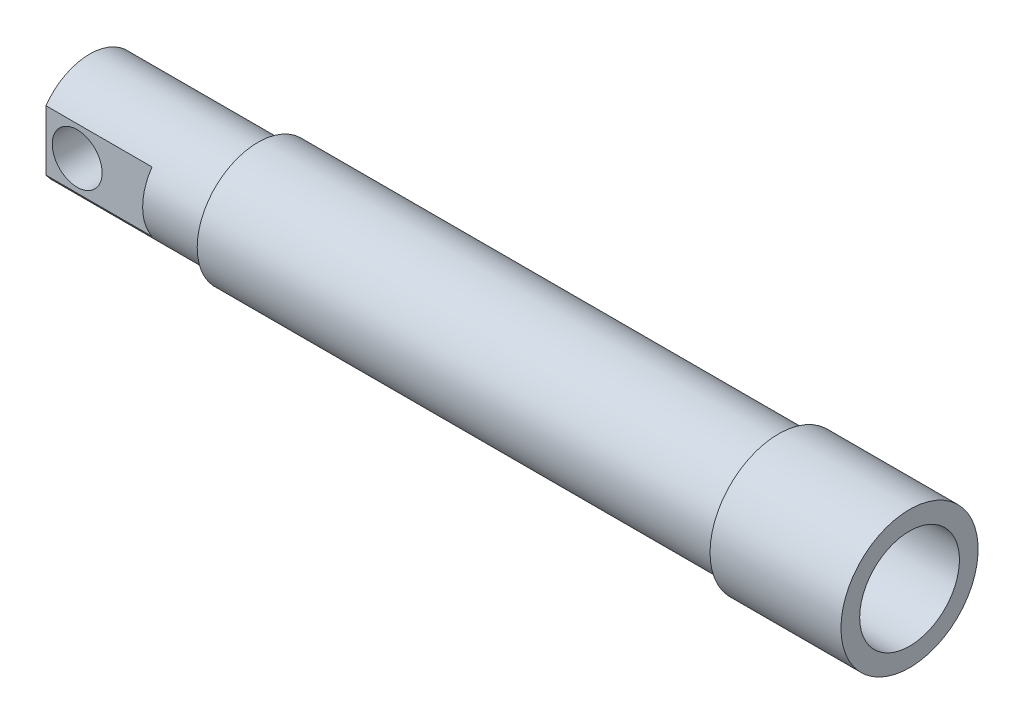
ISO-10303-21;
HEADER;
FILE_DESCRIPTION(('STEP AP214'),'2;1');
FILE_NAME('part.step','',(''),(''),'','','');
FILE_SCHEMA(('AUTOMOTIVE_DESIGN { 1 0 10303 214 1 1 1 1 }'));
ENDSEC;
DATA;
#1=APPLICATION_CONTEXT('core data for automotive mechanical design processes');
#2=APPLICATION_PROTOCOL_DEFINITION('international standard','automotive_design',2000,#1);
#3=PRODUCT_CONTEXT('',#1,'mechanical');
#4=PRODUCT('Part','Part','',(#3));
#5=PRODUCT_RELATED_PRODUCT_CATEGORY('part','',(#4));
#6=PRODUCT_DEFINITION_FORMATION('','',#4);
#7=PRODUCT_DEFINITION_CONTEXT('part definition',#1,'design');
#8=PRODUCT_DEFINITION('design','',#6,#7);
#9=PRODUCT_DEFINITION_SHAPE('','',#8);
#10=(LENGTH_UNIT() NAMED_UNIT(*) SI_UNIT(.MILLI.,.METRE.));
#11=(NAMED_UNIT(*) PLANE_ANGLE_UNIT() SI_UNIT($,.RADIAN.));
#12=(NAMED_UNIT(*) SI_UNIT($,.STERADIAN.) SOLID_ANGLE_UNIT());
#13=UNCERTAINTY_MEASURE_WITH_UNIT(LENGTH_MEASURE(1.E-05),#10,'distance_accuracy_value','');
#14=(GEOMETRIC_REPRESENTATION_CONTEXT(3) GLOBAL_UNCERTAINTY_ASSIGNED_CONTEXT((#13)) GLOBAL_UNIT_ASSIGNED_CONTEXT((#10,
#11,#12)) REPRESENTATION_CONTEXT('',''));
#15=CARTESIAN_POINT('',(0.,0.,0.));
#16=DIRECTION('',(0.,0.,1.));
#17=DIRECTION('',(1.,0.,0.));
#18=AXIS2_PLACEMENT_3D('',#15,#16,#17);
#19=CARTESIAN_POINT('',(-165.89375,30.95625,0.));
#20=DIRECTION('',(1.,0.,0.));
#21=DIRECTION('',(0.,0.,-1.));
#22=AXIS2_PLACEMENT_3D('',#19,#20,#21);
#23=PLANE('',#22);
#24=CARTESIAN_POINT('',(-165.89375,0.,0.));
#25=DIRECTION('',(1.,0.,0.));
#26=DIRECTION('',(0.,0.,-1.));
#27=AXIS2_PLACEMENT_3D('',#24,#25,#26);
#28=CIRCLE('',#27,26.9875);
#29=CARTESIAN_POINT('',(-165.89375,0.,-26.9875));
#30=VERTEX_POINT('',#29);
#31=EDGE_CURVE('E49',#30,#30,#28,.F.);
#32=ORIENTED_EDGE('',*,*,#31,.F.);
#33=EDGE_LOOP('',(#32));
#34=FACE_BOUND('',#33,.T.);
#35=CARTESIAN_POINT('',(-165.89375,0.,0.));
#36=DIRECTION('',(-1.,0.,0.));
#37=DIRECTION('',(0.,0.,1.));
#38=AXIS2_PLACEMENT_3D('',#35,#36,#37);
#39=CIRCLE('',#38,30.95625);
#40=CARTESIAN_POINT('',(-165.89375,0.,30.95625));
#41=VERTEX_POINT('',#40);
#42=EDGE_CURVE('E120',#41,#41,#39,.T.);
#43=ORIENTED_EDGE('',*,*,#42,.T.);
#44=EDGE_LOOP('',(#43));
#45=FACE_BOUND('',#44,.T.);
#46=ADVANCED_FACE('F37',(#34,#45),#23,.F.);
#47=CARTESIAN_POINT('',(-165.89375,0.,0.));
#48=DIRECTION('',(-1.,0.,0.));
#49=DIRECTION('',(0.,0.,1.));
#50=AXIS2_PLACEMENT_3D('',#47,#48,#49);
#51=CYLINDRICAL_SURFACE('',#50,25.4);
#52=CARTESIAN_POINT('',(165.89375,0.,0.));
#53=DIRECTION('',(-1.,0.,0.));
#54=DIRECTION('',(0.,0.,1.));
#55=AXIS2_PLACEMENT_3D('',#52,#53,#54);
#56=CIRCLE('',#55,25.4);
#57=CARTESIAN_POINT('',(165.89375,0.,25.4));
#58=VERTEX_POINT('',#57);
#59=EDGE_CURVE('E132',#58,#58,#56,.T.);
#60=ORIENTED_EDGE('',*,*,#59,.F.);
#61=EDGE_LOOP('',(#60));
#62=FACE_BOUND('',#61,.T.);
#63=CARTESIAN_POINT('',(-165.89375,0.,0.));
#64=DIRECTION('',(-1.,0.,0.));
#65=DIRECTION('',(0.,0.,1.));
#66=AXIS2_PLACEMENT_3D('',#63,#64,#65);
#67=CIRCLE('',#66,25.4);
#68=CARTESIAN_POINT('',(-165.89375,0.,25.4));
#69=VERTEX_POINT('',#68);
#70=EDGE_CURVE('E117',#69,#69,#67,.F.);
#71=ORIENTED_EDGE('',*,*,#70,.F.);
#72=EDGE_LOOP('',(#71));
#73=FACE_BOUND('',#72,.T.);
#74=ADVANCED_FACE('F193',(#62,#73),#51,.F.);
#75=CARTESIAN_POINT('',(165.89375,34.925,0.));
#76=DIRECTION('',(-1.,0.,0.));
#77=DIRECTION('',(0.,0.,1.));
#78=AXIS2_PLACEMENT_3D('',#75,#76,#77);
#79=PLANE('',#78);
#80=CARTESIAN_POINT('',(165.89375,0.,0.));
#81=DIRECTION('',(-1.,0.,0.));
#82=DIRECTION('',(0.,0.,1.));
#83=AXIS2_PLACEMENT_3D('',#80,#81,#82);
#84=CIRCLE('',#83,34.925);
#85=CARTESIAN_POINT('',(165.89375,0.,34.925));
#86=VERTEX_POINT('',#85);
#87=EDGE_CURVE('E129',#86,#86,#84,.T.);
#88=ORIENTED_EDGE('',*,*,#87,.F.);
#89=EDGE_LOOP('',(#88));
#90=FACE_BOUND('',#89,.T.);
#91=ORIENTED_EDGE('',*,*,#59,.T.);
#92=EDGE_LOOP('',(#91));
#93=FACE_BOUND('',#92,.T.);
#94=ADVANCED_FACE('F198',(#90,#93),#79,.F.);
#95=CARTESIAN_POINT('',(-165.89375,0.,0.));
#96=DIRECTION('',(-1.,0.,0.));
#97=DIRECTION('',(0.,0.,1.));
#98=AXIS2_PLACEMENT_3D('',#95,#96,#97);
#99=CYLINDRICAL_SURFACE('',#98,34.925);
#100=CARTESIAN_POINT('',(99.21875,0.,0.));
#101=DIRECTION('',(-1.,0.,0.));
#102=DIRECTION('',(0.,0.,1.));
#103=AXIS2_PLACEMENT_3D('',#100,#101,#102);
#104=CIRCLE('',#103,34.925);
#105=CARTESIAN_POINT('',(99.21875,0.,34.925));
#106=VERTEX_POINT('',#105);
#107=EDGE_CURVE('E126',#106,#106,#104,.T.);
#108=ORIENTED_EDGE('',*,*,#107,.F.);
#109=EDGE_LOOP('',(#108));
#110=FACE_BOUND('',#109,.T.);
#111=ORIENTED_EDGE('',*,*,#87,.T.);
#112=EDGE_LOOP('',(#111));
#113=FACE_BOUND('',#112,.T.);
#114=ADVANCED_FACE('F208',(#110,#113),#99,.T.);
#115=CARTESIAN_POINT('',(99.21875,34.925,0.));
#116=DIRECTION('',(1.,0.,0.));
#117=DIRECTION('',(0.,0.,-1.));
#118=AXIS2_PLACEMENT_3D('',#115,#116,#117);
#119=PLANE('',#118);
#120=CARTESIAN_POINT('',(99.21875,0.,0.));
#121=DIRECTION('',(-1.,0.,0.));
#122=DIRECTION('',(0.,0.,1.));
#123=AXIS2_PLACEMENT_3D('',#120,#121,#122);
#124=CIRCLE('',#123,30.95625);
#125=CARTESIAN_POINT('',(99.21875,0.,30.95625));
#126=VERTEX_POINT('',#125);
#127=EDGE_CURVE('E123',#126,#126,#124,.T.);
#128=ORIENTED_EDGE('',*,*,#127,.F.);
#129=EDGE_LOOP('',(#128));
#130=FACE_BOUND('',#129,.T.);
#131=ORIENTED_EDGE('',*,*,#107,.T.);
#132=EDGE_LOOP('',(#131));
#133=FACE_BOUND('',#132,.T.);
#134=ADVANCED_FACE('F188',(#130,#133),#119,.F.);
#135=CARTESIAN_POINT('',(-165.89375,0.,0.));
#136=DIRECTION('',(-1.,0.,0.));
#137=DIRECTION('',(0.,0.,1.));
#138=AXIS2_PLACEMENT_3D('',#135,#136,#137);
#139=CYLINDRICAL_SURFACE('',#138,30.95625);
#140=ORIENTED_EDGE('',*,*,#42,.F.);
#141=EDGE_LOOP('',(#140));
#142=FACE_BOUND('',#141,.T.);
#143=ORIENTED_EDGE('',*,*,#127,.T.);
#144=EDGE_LOOP('',(#143));
#145=FACE_BOUND('',#144,.T.);
#146=ADVANCED_FACE('F181',(#142,#145),#139,.T.);
#147=CARTESIAN_POINT('',(-165.89375,0.,0.));
#148=DIRECTION('',(-1.,0.,0.));
#149=DIRECTION('',(0.,0.,1.));
#150=AXIS2_PLACEMENT_3D('',#147,#148,#149);
#151=PLANE('',#150);
#152=CARTESIAN_POINT('',(-165.89375,0.,0.));
#153=DIRECTION('',(1.,0.,0.));
#154=DIRECTION('',(0.,0.,-1.));
#155=AXIS2_PLACEMENT_3D('',#152,#153,#154);
#156=CIRCLE('',#155,12.7);
#157=CARTESIAN_POINT('',(-165.89375,0.,-12.7));
#158=VERTEX_POINT('',#157);
#159=EDGE_CURVE('E333',#158,#158,#156,.T.);
#160=ORIENTED_EDGE('',*,*,#159,.F.);
#161=EDGE_LOOP('',(#160));
#162=FACE_BOUND('',#161,.T.);
#163=ORIENTED_EDGE('',*,*,#70,.T.);
#164=EDGE_LOOP('',(#163));
#165=FACE_BOUND('',#164,.T.);
#166=ADVANCED_FACE('F179',(#162,#165),#151,.F.);
#167=CARTESIAN_POINT('',(-251.61875,0.,0.));
#168=DIRECTION('',(1.,0.,0.));
#169=DIRECTION('',(0.,0.,-1.));
#170=AXIS2_PLACEMENT_3D('',#167,#168,#169);
#171=CYLINDRICAL_SURFACE('',#170,26.9875);
#172=CARTESIAN_POINT('',(-186.392261669094,-5.04579702782922,-26.5116029052177));
#173=CARTESIAN_POINT('',(-186.250536423171,-5.17467048686301,-26.4870757779036));
#174=CARTESIAN_POINT('',(-186.103427583179,-5.29756527713831,-26.4627119451883));
#175=CARTESIAN_POINT('',(-185.799289560818,-5.53071218692261,-26.4149679600468));
#176=CARTESIAN_POINT('',(-185.642259068721,-5.64096263185791,-26.3915879381723));
#177=CARTESIAN_POINT('',(-185.319313144608,-5.848041723943,-26.3464761514165));
#178=CARTESIAN_POINT('',(-185.153395588847,-5.94486714289419,-26.3247447835396));
#179=CARTESIAN_POINT('',(-184.813745617924,-6.12441218405678,-26.2835541961286));
#180=CARTESIAN_POINT('',(-184.64001049802,-6.2071268760356,-26.2640957714975));
#181=CARTESIAN_POINT('',(-184.285830851126,-6.35784174477752,-26.2280197180584));
#182=CARTESIAN_POINT('',(-184.105381484053,-6.42583105588677,-26.211404188869));
#183=CARTESIAN_POINT('',(-183.739155610966,-6.54648182914049,-26.1815316271667));
#184=CARTESIAN_POINT('',(-183.553379117768,-6.59914332816103,-26.1682745865738));
#185=CARTESIAN_POINT('',(-183.177884168375,-6.68869249807433,-26.1455289843138));
#186=CARTESIAN_POINT('',(-182.988166732659,-6.7255842003447,-26.1360394595664));
#187=CARTESIAN_POINT('',(-182.606141683129,-6.78329773204074,-26.1211201832975));
#188=CARTESIAN_POINT('',(-182.413834063138,-6.80411952313156,-26.1156904414607));
#189=CARTESIAN_POINT('',(-182.031988994006,-6.82925329399648,-26.1091290484421));
#190=CARTESIAN_POINT('',(-181.842474400969,-6.83389135220498,-26.107912511189));
#191=CARTESIAN_POINT('',(-181.463726500967,-6.82752853424998,-26.1095771996138));
#192=CARTESIAN_POINT('',(-181.27449319192,-6.81652777440583,-26.1124583948135));
#193=CARTESIAN_POINT('',(-180.897682094271,-6.77898082265621,-26.1222309503642));
#194=CARTESIAN_POINT('',(-180.710104299828,-6.75243468562072,-26.1291222965608));
#195=CARTESIAN_POINT('',(-180.337951153634,-6.6840192709836,-26.1467070136892));
#196=CARTESIAN_POINT('',(-180.15337574138,-6.64215030256418,-26.1574003079055));
#197=CARTESIAN_POINT('',(-179.790104916455,-6.54385794720522,-26.1821622781999));
#198=CARTESIAN_POINT('',(-179.611372369392,-6.48756406055336,-26.1962008471762));
#199=CARTESIAN_POINT('',(-179.259328678259,-6.36068384131281,-26.2272972320225));
#200=CARTESIAN_POINT('',(-179.086017521331,-6.29009754263017,-26.2443550407299));
#201=CARTESIAN_POINT('',(-178.745900503658,-6.13512755640031,-26.2810141283267));
#202=CARTESIAN_POINT('',(-178.579096496955,-6.050739971589,-26.3006161253309));
#203=CARTESIAN_POINT('',(-178.253163186146,-5.8688024028526,-26.3418110089661));
#204=CARTESIAN_POINT('',(-178.094031370388,-5.77125676675434,-26.3634032372199));
#205=CARTESIAN_POINT('',(-177.780694379556,-5.56116238429616,-26.408529713484));
#206=CARTESIAN_POINT('',(-177.626696149499,-5.44831218893427,-26.4320979180825));
#207=CARTESIAN_POINT('',(-177.328775525838,-5.21027506077945,-26.4800475954664));
#208=CARTESIAN_POINT('',(-177.184849701856,-5.08509236340556,-26.5044287871532));
#209=CARTESIAN_POINT('',(-176.907885364481,-4.82310965517499,-26.5533525251502));
#210=CARTESIAN_POINT('',(-176.774852148781,-4.68630405657636,-26.5778951437761));
#211=CARTESIAN_POINT('',(-176.520682078197,-4.40205922008149,-26.6264493964816));
#212=CARTESIAN_POINT('',(-176.399540891227,-4.25462388863677,-26.650461221433));
#213=CARTESIAN_POINT('',(-176.167905287687,-3.94733326771116,-26.6977208558338));
#214=CARTESIAN_POINT('',(-176.057635924575,-3.78730498595382,-26.7209477649924));
#215=CARTESIAN_POINT('',(-175.851073684923,-3.45830362838087,-26.7655157637994));
#216=CARTESIAN_POINT('',(-175.754775485018,-3.28933399311441,-26.7868575705004));
#217=CARTESIAN_POINT('',(-175.576825285441,-2.94350030663706,-26.8270622790237));
#218=CARTESIAN_POINT('',(-175.495177617718,-2.76663393971961,-26.8459244472136));
#219=CARTESIAN_POINT('',(-175.347260746112,-2.40637723442904,-26.8806107137619));
#220=CARTESIAN_POINT('',(-175.280985155443,-2.22298964215015,-26.8964360733792));
#221=CARTESIAN_POINT('',(-175.165383625288,-1.85430161674489,-26.9243436704537));
#222=CARTESIAN_POINT('',(-175.115774880156,-1.66909455665889,-26.9364879791492));
#223=CARTESIAN_POINT('',(-175.032336354135,-1.29502932191799,-26.957060750188));
#224=CARTESIAN_POINT('',(-174.998500411167,-1.10617260318463,-26.9654906635913));
#225=CARTESIAN_POINT('',(-174.946879031483,-0.72613832780656,-26.9783992745805));
#226=CARTESIAN_POINT('',(-174.929094011667,-0.534960711010345,-26.9828778695362));
#227=CARTESIAN_POINT('',(-174.909737591227,-0.151735841851381,-26.9877537076875));
#228=CARTESIAN_POINT('',(-174.908165882018,0.0403113938905078,-26.988151028561));
#229=CARTESIAN_POINT('',(-174.921063623286,0.418387469563219,-26.9849001120755));
#230=CARTESIAN_POINT('',(-174.935080647124,0.604432906302701,-26.9813659753375));
#231=CARTESIAN_POINT('',(-174.978322604201,0.974701930605113,-26.9705288771205));
#232=CARTESIAN_POINT('',(-175.007552760437,1.15892487031678,-26.9632246212854));
#233=CARTESIAN_POINT('',(-175.080963973508,1.5241150125974,-26.9450486027787));
#234=CARTESIAN_POINT('',(-175.1251395567,1.70508338160824,-26.9341781462435));
#235=CARTESIAN_POINT('',(-175.22810127867,2.06265322589853,-26.9091574289563));
#236=CARTESIAN_POINT('',(-175.286892887558,2.23925303895818,-26.8950059403977));
#237=CARTESIAN_POINT('',(-175.41873804909,2.58715779850761,-26.8637736546511));
#238=CARTESIAN_POINT('',(-175.491818213471,2.75845216347012,-26.84668739893));
#239=CARTESIAN_POINT('',(-175.651644643415,3.09434072928439,-26.810049739681));
#240=CARTESIAN_POINT('',(-175.738395862091,3.25893247442813,-26.7904974432047));
#241=CARTESIAN_POINT('',(-175.924898279815,3.58027285651753,-26.7494492831708));
#242=CARTESIAN_POINT('',(-176.024646697574,3.73702316156165,-26.7279538357317));
#243=CARTESIAN_POINT('',(-176.236506863479,4.04180303695279,-26.683566344663));
#244=CARTESIAN_POINT('',(-176.348622990651,4.18982948980759,-26.6606738076572));
#245=CARTESIAN_POINT('',(-176.587882781283,4.48036952421489,-26.6134126885237));
#246=CARTESIAN_POINT('',(-176.715368638833,4.62259760690472,-26.5890205419285));
#247=CARTESIAN_POINT('',(-176.98176123065,4.89589046116976,-26.5400582182147));
#248=CARTESIAN_POINT('',(-177.120668146521,5.02695505517045,-26.5154880382709));
#249=CARTESIAN_POINT('',(-177.409030262727,5.27710805656318,-26.4668383396822));
#250=CARTESIAN_POINT('',(-177.558488519421,5.39619296943321,-26.4427589658313));
#251=CARTESIAN_POINT('',(-177.866889243794,5.62151324252796,-26.3957759762721));
#252=CARTESIAN_POINT('',(-178.025828390678,5.72775306288999,-26.3728719540515));
#253=CARTESIAN_POINT('',(-178.35487569215,5.92833161421638,-26.3285162435223));
#254=CARTESIAN_POINT('',(-178.525124069254,6.02244711154943,-26.307094459504));
#255=CARTESIAN_POINT('',(-178.873165206865,6.19596856507018,-26.2667673289865));
#256=CARTESIAN_POINT('',(-179.050955064578,6.27538011893211,-26.2478610256384));
#257=CARTESIAN_POINT('',(-179.412943102961,6.41893898386478,-26.2131234058343));
#258=CARTESIAN_POINT('',(-179.597142956109,6.48308227643205,-26.1972928991084));
#259=CARTESIAN_POINT('',(-179.970502482774,6.59552961861008,-26.1692091408634));
#260=CARTESIAN_POINT('',(-180.159660078193,6.64384019355301,-26.1569544158425));
#261=CARTESIAN_POINT('',(-180.538007076371,6.72348905687816,-26.1365933149381));
#262=CARTESIAN_POINT('',(-180.727128896678,6.75512962205538,-26.1284132150507));
#263=CARTESIAN_POINT('',(-181.107412788081,6.80252315089688,-26.1161145011886));
#264=CARTESIAN_POINT('',(-181.298574050676,6.81828219009398,-26.111994334086));
#265=CARTESIAN_POINT('',(-181.681601853543,6.83379754465113,-26.1079381047464));
#266=CARTESIAN_POINT('',(-181.873468439493,6.8335528046518,-26.1080023184459));
#267=CARTESIAN_POINT('',(-182.25646377488,6.81705996832146,-26.1123136124696));
#268=CARTESIAN_POINT('',(-182.447592532582,6.80081205180353,-26.1165606457953));
#269=CARTESIAN_POINT('',(-182.823592383942,6.75297670542061,-26.1289696491707));
#270=CARTESIAN_POINT('',(-183.008509525579,6.72172774340217,-26.1370451891083));
#271=CARTESIAN_POINT('',(-183.375054525007,6.64428598582452,-26.1568387935725));
#272=CARTESIAN_POINT('',(-183.556681228361,6.59808804873744,-26.1685581112801));
#273=CARTESIAN_POINT('',(-183.915283761706,6.49113081415387,-26.1952936813622));
#274=CARTESIAN_POINT('',(-184.092260961558,6.43037586014546,-26.2103089501868));
#275=CARTESIAN_POINT('',(-184.440509711074,6.29473071930518,-26.2432160747665));
#276=CARTESIAN_POINT('',(-184.611779093696,6.21983523418675,-26.2611090083743));
#277=CARTESIAN_POINT('',(-184.949439095778,6.0554879006278,-26.2994947538319));
#278=CARTESIAN_POINT('',(-185.115747120493,5.96587303261272,-26.3200160393036));
#279=CARTESIAN_POINT('',(-185.440294672129,5.7733341418305,-26.3629189578763));
#280=CARTESIAN_POINT('',(-185.598531388464,5.67040552647872,-26.3853012319701));
#281=CARTESIAN_POINT('',(-185.905864282227,5.45195855338,-26.4313026186873));
#282=CARTESIAN_POINT('',(-186.054960667093,5.33644048151037,-26.4549217032192));
#283=CARTESIAN_POINT('',(-186.343072469744,5.09356230594345,-26.5027563695337));
#284=CARTESIAN_POINT('',(-186.482087748181,4.96620203860976,-26.5269719595556));
#285=CARTESIAN_POINT('',(-186.752610182114,4.69699897959174,-26.5759769514085));
#286=CARTESIAN_POINT('',(-186.883829439745,4.55486642611728,-26.6007649623598));
#287=CARTESIAN_POINT('',(-187.133773090665,4.25997229908266,-26.649580043624));
#288=CARTESIAN_POINT('',(-187.252501726343,4.10721436386467,-26.6736073703492));
#289=CARTESIAN_POINT('',(-187.476712906649,3.79197269897289,-26.7202449796423));
#290=CARTESIAN_POINT('',(-187.582190429336,3.62948531624964,-26.7428547233545));
#291=CARTESIAN_POINT('',(-187.779021036498,3.29599232595596,-26.7860009008506));
#292=CARTESIAN_POINT('',(-187.870379729241,3.12499013650227,-26.8065381567353));
#293=CARTESIAN_POINT('',(-188.038064374411,2.77608964047385,-26.8449099388374));
#294=CARTESIAN_POINT('',(-188.114433165518,2.59821277732678,-26.862752132401));
#295=CARTESIAN_POINT('',(-188.251816285518,2.23642123392476,-26.8952885590764));
#296=CARTESIAN_POINT('',(-188.312836527962,2.05250891000577,-26.9099840042545));
#297=CARTESIAN_POINT('',(-188.419038301406,1.67991937858994,-26.9358106700393));
#298=CARTESIAN_POINT('',(-188.464219844397,1.49124217470059,-26.9469418933445));
#299=CARTESIAN_POINT('',(-188.5383409576,1.11053844844856,-26.9653142511481));
#300=CARTESIAN_POINT('',(-188.567280966799,0.918512016755795,-26.9725554907876));
#301=CARTESIAN_POINT('',(-188.608034798213,0.53837478456828,-26.9827791773405));
#302=CARTESIAN_POINT('',(-188.62033649226,0.350319404291672,-26.9858829037786));
#303=CARTESIAN_POINT('',(-188.629305540543,-0.026254861065838,-26.9881442497918));
#304=CARTESIAN_POINT('',(-188.625967469468,-0.214773884311966,-26.9873005000186));
#305=CARTESIAN_POINT('',(-188.60367751096,-0.590759776752632,-26.981688192795));
#306=CARTESIAN_POINT('',(-188.584731115644,-0.77822699269042,-26.9769210158854));
#307=CARTESIAN_POINT('',(-188.531386998953,-1.1508823649204,-26.9635940177331));
#308=CARTESIAN_POINT('',(-188.496983631201,-1.33606966294557,-26.9550328105599));
#309=CARTESIAN_POINT('',(-188.413585021981,-1.70029337974437,-26.9344942842804));
#310=CARTESIAN_POINT('',(-188.364792966226,-1.87937907946741,-26.9225646254356));
#311=CARTESIAN_POINT('',(-188.252829546691,-2.2328249969611,-26.8955587406129));
#312=CARTESIAN_POINT('',(-188.189652688075,-2.40718338039298,-26.8804813124051));
#313=CARTESIAN_POINT('',(-188.049460514232,-2.7498427130672,-26.8475905584058));
#314=CARTESIAN_POINT('',(-187.972454685885,-2.91814772060064,-26.8297791094027));
#315=CARTESIAN_POINT('',(-187.805145268144,-3.24776686479375,-26.7918781043527));
#316=CARTESIAN_POINT('',(-187.714837908132,-3.40907900233078,-26.7717879027149));
#317=CARTESIAN_POINT('',(-187.449833005632,-3.84039192571637,-26.7142803824784));
#318=CARTESIAN_POINT('',(-187.262195526173,-4.10233876447399,-26.6750566136325));
#319=CARTESIAN_POINT('',(-186.852168125117,-4.59705503246685,-26.5942701383527));
#320=CARTESIAN_POINT('',(-186.629774928349,-4.82982170820869,-26.5527072117271));
#321=CARTESIAN_POINT('',(-186.392261669094,-5.04579702782922,-26.5116029052177));
#322=B_SPLINE_CURVE_WITH_KNOTS('',3,(#172,#173,#174,#175,#176,#177,#178,#179,#180,#181,#182,
#183,#184,#185,#186,#187,#188,#189,#190,#191,#192,#193,#194,#195,#196,#197,#198,#199,#200,#201,
#202,#203,#204,#205,#206,#207,#208,#209,#210,#211,#212,#213,#214,#215,#216,#217,#218,#219,#220,
#221,#222,#223,#224,#225,#226,#227,#228,#229,#230,#231,#232,#233,#234,#235,#236,#237,#238,#239,
#240,#241,#242,#243,#244,#245,#246,#247,#248,#249,#250,#251,#252,#253,#254,#255,#256,#257,#258,
#259,#260,#261,#262,#263,#264,#265,#266,#267,#268,#269,#270,#271,#272,#273,#274,#275,#276,#277,
#278,#279,#280,#281,#282,#283,#284,#285,#286,#287,#288,#289,#290,#291,#292,#293,#294,#295,#296,
#297,#298,#299,#300,#301,#302,#303,#304,#305,#306,#307,#308,#309,#310,#311,#312,#313,#314,#315,
#316,#317,#318,#319,#320,#321),.UNSPECIFIED.,.T.,.F.,(4,2,2,2,2,2,2,2,2,2,2,2,2,2,2,2,2,2,2,2,2,
2,2,2,2,2,2,2,2,2,2,2,2,2,2,2,2,2,2,2,2,2,2,2,2,2,2,2,2,2,2,2,2,2,2,2,2,2,2,2,2,2,2,2,2,2,2,2,2,
2,2,2,2,2,4),(0.,0.5790948292413,1.15826626346669,1.73757672534379,2.31708918330057,
2.89702780949127,3.47696504043861,4.05675392792786,4.63654419850249,5.20458287275671,
5.77261732204048,6.34064976636444,6.90867074963111,7.471760811692,8.0348495379438,
8.59809754693381,9.16115989521009,9.73760295554845,10.3138487304808,10.8903731220053,
11.4666867089749,12.0531490423072,12.6393873285396,13.2257986722766,13.8119659357811,
14.3876149739827,14.9630389302112,15.5384778318728,16.1139057813176,16.6730591987846,
17.2324047124512,17.7915455917124,18.3508960477166,18.9112983645298,19.4719041876239,
20.0323902422308,20.5930753884981,21.1700655180058,21.7470648238221,22.3242319575897,
22.9011981054268,23.4876070499175,24.0737922921327,24.6601316441867,25.2462290362169,
25.8212972510678,26.3961453879732,26.9710314329238,27.5459110184784,28.1083891984882,
28.6710610423855,29.2335652062123,29.7962805533476,30.3657100487602,30.9353364956556,
31.5049500103517,32.074571397183,32.6589531274324,33.2431357295798,33.827539063139,
34.4117096605918,34.9941856775244,35.5764369308157,36.1586877432962,36.7409228175387,
37.3056858369122,37.8706447826174,38.4354050205062,39.0003717313034,39.5577141068812,
40.115269739341,40.6724443313681,41.2297771720263,42.2001740241275,43.1706623758307),.UNSPECIFIED.);
#323=CARTESIAN_POINT('',(-186.392261669094,-5.04579702782922,-26.5116029052177));
#324=VERTEX_POINT('',#323);
#325=EDGE_CURVE('E11',#324,#324,#322,.T.);
#326=ORIENTED_EDGE('',*,*,#325,.T.);
#327=EDGE_LOOP('',(#326));
#328=FACE_BOUND('',#327,.T.);
#329=CARTESIAN_POINT('',(-251.61875,0.,0.));
#330=DIRECTION('',(-1.,0.,0.));
#331=DIRECTION('',(0.,0.,1.));
#332=AXIS2_PLACEMENT_3D('',#329,#330,#331);
#333=CIRCLE('',#332,26.9875);
#334=CARTESIAN_POINT('',(-251.61875,15.3092955830763,22.225));
#335=VERTEX_POINT('',#334);
#336=CARTESIAN_POINT('',(-251.61875,15.3092955830763,-22.225));
#337=VERTEX_POINT('',#336);
#338=EDGE_CURVE('E99',#335,#337,#333,.T.);
#339=ORIENTED_EDGE('',*,*,#338,.F.);
#340=DIRECTION('',(-1.,0.,0.));
#341=VECTOR('',#340,1.);
#342=CARTESIAN_POINT('',(-197.64375,15.3092955830763,22.225));
#343=LINE('',#342,#341);
#344=CARTESIAN_POINT('',(-197.64375,15.3092955830763,22.225));
#345=VERTEX_POINT('',#344);
#346=EDGE_CURVE('E56',#345,#335,#343,.T.);
#347=ORIENTED_EDGE('',*,*,#346,.F.);
#348=CARTESIAN_POINT('',(-197.64375,0.,0.));
#349=DIRECTION('',(-1.,0.,0.));
#350=DIRECTION('',(0.,0.,1.));
#351=AXIS2_PLACEMENT_3D('',#348,#349,#350);
#352=CIRCLE('',#351,26.9875);
#353=CARTESIAN_POINT('',(-197.64375,-15.3092955830763,22.225));
#354=VERTEX_POINT('',#353);
#355=EDGE_CURVE('E85',#354,#345,#352,.T.);
#356=ORIENTED_EDGE('',*,*,#355,.F.);
#357=DIRECTION('',(-1.,0.,0.));
#358=VECTOR('',#357,1.);
#359=CARTESIAN_POINT('',(-197.64375,-15.3092955830763,22.225));
#360=LINE('',#359,#358);
#361=CARTESIAN_POINT('',(-251.61875,-15.3092955830763,22.225));
#362=VERTEX_POINT('',#361);
#363=EDGE_CURVE('E93',#354,#362,#360,.T.);
#364=ORIENTED_EDGE('',*,*,#363,.T.);
#365=CARTESIAN_POINT('',(-251.61875,-15.3092955830763,-22.225));
#366=VERTEX_POINT('',#365);
#367=EDGE_CURVE('E114',#366,#362,#333,.T.);
#368=ORIENTED_EDGE('',*,*,#367,.F.);
#369=DIRECTION('',(-1.,0.,0.));
#370=VECTOR('',#369,1.);
#371=CARTESIAN_POINT('',(-197.64375,-15.3092955830763,-22.225));
#372=LINE('',#371,#370);
#373=CARTESIAN_POINT('',(-197.64375,-15.3092955830763,-22.225));
#374=VERTEX_POINT('',#373);
#375=EDGE_CURVE('E64',#374,#366,#372,.T.);
#376=ORIENTED_EDGE('',*,*,#375,.F.);
#377=CARTESIAN_POINT('',(-197.64375,0.,0.));
#378=DIRECTION('',(-1.,0.,0.));
#379=DIRECTION('',(0.,0.,1.));
#380=AXIS2_PLACEMENT_3D('',#377,#378,#379);
#381=CIRCLE('',#380,26.9875);
#382=CARTESIAN_POINT('',(-197.64375,15.3092955830763,-22.225));
#383=VERTEX_POINT('',#382);
#384=EDGE_CURVE('E105',#383,#374,#381,.T.);
#385=ORIENTED_EDGE('',*,*,#384,.F.);
#386=DIRECTION('',(-1.,0.,0.));
#387=VECTOR('',#386,1.);
#388=CARTESIAN_POINT('',(-197.64375,15.3092955830763,-22.225));
#389=LINE('',#388,#387);
#390=EDGE_CURVE('E111',#383,#337,#389,.T.);
#391=ORIENTED_EDGE('',*,*,#390,.T.);
#392=EDGE_LOOP('',(#339,#347,#356,#364,#368,#376,#385,#391));
#393=FACE_BOUND('',#392,.T.);
#394=ORIENTED_EDGE('',*,*,#31,.T.);
#395=EDGE_LOOP('',(#394));
#396=FACE_BOUND('',#395,.T.);
#397=ADVANCED_FACE('F96',(#328,#393,#396),#171,.T.);
#398=CARTESIAN_POINT('',(-251.61875,0.,0.));
#399=DIRECTION('',(-1.,0.,0.));
#400=DIRECTION('',(0.,0.,1.));
#401=AXIS2_PLACEMENT_3D('',#398,#399,#400);
#402=PLANE('',#401);
#403=DIRECTION('',(0.,-1.,0.));
#404=VECTOR('',#403,1.);
#405=CARTESIAN_POINT('',(-251.61875,15.3092955830763,22.225));
#406=LINE('',#405,#404);
#407=EDGE_CURVE('E90',#335,#362,#406,.T.);
#408=ORIENTED_EDGE('',*,*,#407,.F.);
#409=ORIENTED_EDGE('',*,*,#338,.T.);
#410=DIRECTION('',(0.,1.,0.));
#411=VECTOR('',#410,1.);
#412=CARTESIAN_POINT('',(-251.61875,15.3092955830763,-22.225));
#413=LINE('',#412,#411);
#414=EDGE_CURVE('E101',#366,#337,#413,.T.);
#415=ORIENTED_EDGE('',*,*,#414,.F.);
#416=ORIENTED_EDGE('',*,*,#367,.T.);
#417=EDGE_LOOP('',(#408,#409,#415,#416));
#418=FACE_BOUND('',#417,.T.);
#419=ADVANCED_FACE('F175',(#418),#402,.T.);
#420=CARTESIAN_POINT('',(-197.64375,15.3092955830763,-22.225));
#421=DIRECTION('',(0.,0.,1.));
#422=DIRECTION('',(0.,-1.,0.));
#423=AXIS2_PLACEMENT_3D('',#420,#421,#422);
#424=PLANE('',#423);
#425=CARTESIAN_POINT('',(-235.74375,0.,-22.225));
#426=DIRECTION('',(0.,0.,1.));
#427=DIRECTION('',(0.,-1.,0.));
#428=AXIS2_PLACEMENT_3D('',#425,#426,#427);
#429=CIRCLE('',#428,12.7);
#430=CARTESIAN_POINT('',(-235.74375,-12.7,-22.225));
#431=VERTEX_POINT('',#430);
#432=EDGE_CURVE('E348',#431,#431,#429,.T.);
#433=ORIENTED_EDGE('',*,*,#432,.T.);
#434=EDGE_LOOP('',(#433));
#435=FACE_BOUND('',#434,.T.);
#436=ORIENTED_EDGE('',*,*,#414,.T.);
#437=ORIENTED_EDGE('',*,*,#390,.F.);
#438=DIRECTION('',(0.,1.,0.));
#439=VECTOR('',#438,1.);
#440=CARTESIAN_POINT('',(-197.64375,15.3092955830763,-22.225));
#441=LINE('',#440,#439);
#442=EDGE_CURVE('E107',#374,#383,#441,.T.);
#443=ORIENTED_EDGE('',*,*,#442,.F.);
#444=ORIENTED_EDGE('',*,*,#375,.T.);
#445=EDGE_LOOP('',(#436,#437,#443,#444));
#446=FACE_BOUND('',#445,.T.);
#447=ADVANCED_FACE('F171',(#435,#446),#424,.F.);
#448=CARTESIAN_POINT('',(-197.64375,0.,0.));
#449=DIRECTION('',(-1.,0.,0.));
#450=DIRECTION('',(0.,0.,1.));
#451=AXIS2_PLACEMENT_3D('',#448,#449,#450);
#452=PLANE('',#451);
#453=ORIENTED_EDGE('',*,*,#384,.T.);
#454=ORIENTED_EDGE('',*,*,#442,.T.);
#455=EDGE_LOOP('',(#453,#454));
#456=FACE_BOUND('',#455,.T.);
#457=ADVANCED_FACE('F167',(#456),#452,.T.);
#458=CARTESIAN_POINT('',(-197.64375,15.3092955830763,22.225));
#459=DIRECTION('',(0.,0.,-1.));
#460=DIRECTION('',(-1.,0.,0.));
#461=AXIS2_PLACEMENT_3D('',#458,#459,#460);
#462=PLANE('',#461);
#463=CARTESIAN_POINT('',(-235.74375,0.,22.225));
#464=DIRECTION('',(0.,0.,1.));
#465=DIRECTION('',(1.,0.,0.));
#466=AXIS2_PLACEMENT_3D('',#463,#464,#465);
#467=CIRCLE('',#466,12.7);
#468=CARTESIAN_POINT('',(-223.04375,0.,22.225));
#469=VERTEX_POINT('',#468);
#470=EDGE_CURVE('E345',#469,#469,#467,.T.);
#471=ORIENTED_EDGE('',*,*,#470,.F.);
#472=EDGE_LOOP('',(#471));
#473=FACE_BOUND('',#472,.T.);
#474=ORIENTED_EDGE('',*,*,#407,.T.);
#475=ORIENTED_EDGE('',*,*,#363,.F.);
#476=DIRECTION('',(0.,-1.,0.));
#477=VECTOR('',#476,1.);
#478=CARTESIAN_POINT('',(-197.64375,15.3092955830763,22.225));
#479=LINE('',#478,#477);
#480=EDGE_CURVE('E87',#345,#354,#479,.T.);
#481=ORIENTED_EDGE('',*,*,#480,.F.);
#482=ORIENTED_EDGE('',*,*,#346,.T.);
#483=EDGE_LOOP('',(#474,#475,#481,#482));
#484=FACE_BOUND('',#483,.T.);
#485=ADVANCED_FACE('F92',(#473,#484),#462,.F.);
#486=CARTESIAN_POINT('',(-197.64375,0.,0.));
#487=DIRECTION('',(-1.,0.,0.));
#488=DIRECTION('',(0.,0.,1.));
#489=AXIS2_PLACEMENT_3D('',#486,#487,#488);
#490=PLANE('',#489);
#491=ORIENTED_EDGE('',*,*,#355,.T.);
#492=ORIENTED_EDGE('',*,*,#480,.T.);
#493=EDGE_LOOP('',(#491,#492));
#494=FACE_BOUND('',#493,.T.);
#495=ADVANCED_FACE('F86',(#494),#490,.T.);
#496=CARTESIAN_POINT('',(-235.74375,0.,-34.925));
#497=DIRECTION('',(0.,0.,1.));
#498=DIRECTION('',(1.,0.,0.));
#499=AXIS2_PLACEMENT_3D('',#496,#497,#498);
#500=CYLINDRICAL_SURFACE('',#499,12.7);
#501=ORIENTED_EDGE('',*,*,#470,.T.);
#502=EDGE_LOOP('',(#501));
#503=FACE_BOUND('',#502,.T.);
#504=ORIENTED_EDGE('',*,*,#432,.F.);
#505=EDGE_LOOP('',(#504));
#506=FACE_BOUND('',#505,.T.);
#507=ADVANCED_FACE('F148',(#503,#506),#500,.F.);
#508=CARTESIAN_POINT('',(-181.76875,0.,-26.9875));
#509=DIRECTION('',(0.,0.,-1.));
#510=DIRECTION('',(-1.,0.,0.));
#511=AXIS2_PLACEMENT_3D('',#508,#509,#510);
#512=CONICAL_SURFACE('',#511,6.858,0.0299323966717036);
#513=CARTESIAN_POINT('',(-181.76875,0.,-16.9672));
#514=DIRECTION('',(0.,0.,-1.));
#515=DIRECTION('',(-1.,0.,0.));
#516=AXIS2_PLACEMENT_3D('',#513,#514,#515);
#517=CIRCLE('',#516,6.55797879910952);
#518=CARTESIAN_POINT('',(-188.32672879911,0.,-16.9672));
#519=VERTEX_POINT('',#518);
#520=EDGE_CURVE('E336',#519,#519,#517,.T.);
#521=ORIENTED_EDGE('',*,*,#520,.F.);
#522=EDGE_LOOP('',(#521));
#523=FACE_BOUND('',#522,.T.);
#524=ORIENTED_EDGE('',*,*,#325,.F.);
#525=EDGE_LOOP('',(#524));
#526=FACE_BOUND('',#525,.T.);
#527=ADVANCED_FACE('F143',(#523,#526),#512,.F.);
#528=CARTESIAN_POINT('',(-181.76875,0.,-26.9875));
#529=DIRECTION('',(0.,0.,-1.));
#530=DIRECTION('',(-1.,0.,0.));
#531=AXIS2_PLACEMENT_3D('',#528,#529,#530);
#532=CYLINDRICAL_SURFACE('',#531,5.5626);
#533=CARTESIAN_POINT('',(-187.33135,0.,-12.7));
#534=CARTESIAN_POINT('',(-187.331348894461,-0.148372742135272,-12.6999990862631));
#535=CARTESIAN_POINT('',(-187.325405773586,-0.296786245851006,-12.6973929427509));
#536=CARTESIAN_POINT('',(-187.301691170427,-0.592547593750622,-12.6870330965476));
#537=CARTESIAN_POINT('',(-187.283912758325,-0.739894762447504,-12.6792763780911));
#538=CARTESIAN_POINT('',(-187.236672701891,-1.03264829355305,-12.6587995399422));
#539=CARTESIAN_POINT('',(-187.20718869304,-1.1780503868102,-12.646069919856));
#540=CARTESIAN_POINT('',(-187.136836571949,-1.46563770853398,-12.615974994685));
#541=CARTESIAN_POINT('',(-187.095963806077,-1.60782159625569,-12.5986077947303));
#542=CARTESIAN_POINT('',(-187.00341973772,-1.88741680063856,-12.5597567970405));
#543=CARTESIAN_POINT('',(-186.951791956269,-2.02484482564003,-12.5382896184661));
#544=CARTESIAN_POINT('',(-186.838104456019,-2.29469714871982,-12.4917235090274));
#545=CARTESIAN_POINT('',(-186.776040831018,-2.42711955034463,-12.466623218758));
#546=CARTESIAN_POINT('',(-186.575004339095,-2.81553858042922,-12.386781848036));
#547=CARTESIAN_POINT('',(-186.42106640977,-3.06304474368826,-12.3274482460086));
#548=CARTESIAN_POINT('',(-186.06915084346,-3.54143509654744,-12.1988847168144));
#549=CARTESIAN_POINT('',(-185.869366029096,-3.77088375501014,-12.1293096903173));
#550=CARTESIAN_POINT('',(-185.435015672239,-4.19439235713304,-11.9894460085296));
#551=CARTESIAN_POINT('',(-185.200430128721,-4.38843180608444,-11.9191569646559));
#552=CARTESIAN_POINT('',(-184.819479072722,-4.65418283110298,-11.8168656500757));
#553=CARTESIAN_POINT('',(-184.683675784992,-4.74043158362253,-11.7824386979313));
#554=CARTESIAN_POINT('',(-184.404588631304,-4.90109783152627,-11.7165168224538));
#555=CARTESIAN_POINT('',(-184.261307917,-4.97552025892186,-11.6850206791491));
#556=CARTESIAN_POINT('',(-183.968135849013,-5.11188469663375,-11.6260123583962));
#557=CARTESIAN_POINT('',(-183.818244407002,-5.17382654012978,-11.5985002342013));
#558=CARTESIAN_POINT('',(-183.512949525335,-5.28456537280293,-11.5484658434519));
#559=CARTESIAN_POINT('',(-183.35754906899,-5.33336935712461,-11.5259409226407));
#560=CARTESIAN_POINT('',(-183.050434450786,-5.41514071545603,-11.4877405871951));
#561=CARTESIAN_POINT('',(-182.898938238904,-5.44879037960347,-11.4717737802383));
#562=CARTESIAN_POINT('',(-182.593236311735,-5.50334742315874,-11.4457015946198));
#563=CARTESIAN_POINT('',(-182.439031924889,-5.52426087982813,-11.4355934205398));
#564=CARTESIAN_POINT('',(-182.129180237451,-5.55309022414817,-11.4216219067539));
#565=CARTESIAN_POINT('',(-181.973533424392,-5.56101035312104,-11.4177565292613));
#566=CARTESIAN_POINT('',(-181.662101579646,-5.5637568157423,-11.4164186353284));
#567=CARTESIAN_POINT('',(-181.506316557026,-5.55858395279401,-11.4189457266376));
#568=CARTESIAN_POINT('',(-181.209431441234,-5.53623374259399,-11.4297965371858));
#569=CARTESIAN_POINT('',(-181.06822933305,-5.52013622439457,-11.4375986173229));
#570=CARTESIAN_POINT('',(-180.787781909148,-5.47725758507002,-11.4581942146671));
#571=CARTESIAN_POINT('',(-180.64853724264,-5.45047300213166,-11.4709893492226));
#572=CARTESIAN_POINT('',(-180.372996213764,-5.38650016359991,-11.5011679853835));
#573=CARTESIAN_POINT('',(-180.236699243187,-5.34931407668036,-11.5185505304887));
#574=CARTESIAN_POINT('',(-179.967830053254,-5.26489250466748,-11.5573810573098));
#575=CARTESIAN_POINT('',(-179.835259298962,-5.21765312772761,-11.5788306131022));
#576=CARTESIAN_POINT('',(-179.438598768659,-5.05915223359865,-11.6494036565202));
#577=CARTESIAN_POINT('',(-179.181460010986,-4.93248313522154,-11.7040679571015));
#578=CARTESIAN_POINT('',(-178.691155425354,-4.64244026210522,-11.8221055920068));
#579=CARTESIAN_POINT('',(-178.457999615606,-4.47905123867145,-11.8854825401767));
#580=CARTESIAN_POINT('',(-177.99897031505,-4.10214217029039,-12.0210739286074));
#581=CARTESIAN_POINT('',(-177.775857913074,-3.88534731704377,-12.0935581028421));
#582=CARTESIAN_POINT('',(-177.368108365574,-3.41661588774429,-12.2342312182966));
#583=CARTESIAN_POINT('',(-177.183482201643,-3.16466931570321,-12.3024189297095));
#584=CARTESIAN_POINT('',(-176.937164404033,-2.76118778299241,-12.3970069895377));
#585=CARTESIAN_POINT('',(-176.859301813351,-2.62027779682808,-12.4276245205198));
#586=CARTESIAN_POINT('',(-176.715829637637,-2.33161961360834,-12.4849970211252));
#587=CARTESIAN_POINT('',(-176.650215024824,-2.18387425368382,-12.5117535746474));
#588=CARTESIAN_POINT('',(-176.531908341033,-1.88260454373778,-12.5606166808738));
#589=CARTESIAN_POINT('',(-176.479212737654,-1.72908178668294,-12.5827245044286));
#590=CARTESIAN_POINT('',(-176.387309656678,-1.41739433447186,-12.6216340079673));
#591=CARTESIAN_POINT('',(-176.348101031166,-1.25923003561486,-12.6384361395238));
#592=CARTESIAN_POINT('',(-176.285858056153,-0.950519808385672,-12.665261713479));
#593=CARTESIAN_POINT('',(-176.261900724261,-0.800192896685875,-12.6756702506317));
#594=CARTESIAN_POINT('',(-176.226379472742,-0.497812028409723,-12.6911423835028));
#595=CARTESIAN_POINT('',(-176.214814781717,-0.345758179924552,-12.6962063119038));
#596=CARTESIAN_POINT('',(-176.204215922511,-0.0411727702807629,-12.7008463604379));
#597=CARTESIAN_POINT('',(-176.205178344408,0.111358649579706,-12.700423973964));
#598=CARTESIAN_POINT('',(-176.21961397026,0.415711497984517,-12.6941068754069));
#599=CARTESIAN_POINT('',(-176.233086839767,0.567532945399775,-12.6882123096136));
#600=CARTESIAN_POINT('',(-176.271274800532,0.860754858869926,-12.6715997098261));
#601=CARTESIAN_POINT('',(-176.295313784282,1.00226055551126,-12.6611721212735));
#602=CARTESIAN_POINT('',(-176.354154002899,1.2826529168866,-12.6358468815242));
#603=CARTESIAN_POINT('',(-176.388958719754,1.42153871881966,-12.6209477841428));
#604=CARTESIAN_POINT('',(-176.468991540479,1.69571847352341,-12.587041179893));
#605=CARTESIAN_POINT('',(-176.514216641747,1.83101344848027,-12.568034856607));
#606=CARTESIAN_POINT('',(-176.614694817819,2.09726348408893,-12.526359744057));
#607=CARTESIAN_POINT('',(-176.66995171814,2.22821686651404,-12.5036895579818));
#608=CARTESIAN_POINT('',(-176.853847718953,2.62135613932147,-12.4294334155412));
#609=CARTESIAN_POINT('',(-176.998166024699,2.87544480601028,-12.3726773952476));
#610=CARTESIAN_POINT('',(-177.323483714754,3.35658368958687,-12.2509255303576));
#611=CARTESIAN_POINT('',(-177.504498965899,3.58362214299455,-12.1859261260967));
#612=CARTESIAN_POINT('',(-177.914648552952,4.02314733648081,-12.0482925341947));
#613=CARTESIAN_POINT('',(-178.146444389863,4.23309368245193,-11.975459508322));
#614=CARTESIAN_POINT('',(-178.643120000065,4.6119863042705,-11.8347181514883));
#615=CARTESIAN_POINT('',(-178.908010395172,4.78091936529213,-11.7668114127471));
#616=CARTESIAN_POINT('',(-179.328338384313,5.00127440711666,-11.6740647856847));
#617=CARTESIAN_POINT('',(-179.473988318991,5.06977367383301,-11.6443983332877));
#618=CARTESIAN_POINT('',(-179.771369050737,5.19412357401388,-11.5894651699638));
#619=CARTESIAN_POINT('',(-179.92309713445,5.24997977903191,-11.5641965221483));
#620=CARTESIAN_POINT('',(-180.231480402042,5.34841211052458,-11.5190027654304));
#621=CARTESIAN_POINT('',(-180.388132801796,5.39099559762817,-11.4990746956753));
#622=CARTESIAN_POINT('',(-180.705190411658,5.46239442017876,-11.4653309166259));
#623=CARTESIAN_POINT('',(-180.865595212936,5.49121124826754,-11.4515145446864));
#624=CARTESIAN_POINT('',(-181.175310262719,5.53287430497904,-11.4314385523717));
#625=CARTESIAN_POINT('',(-181.3244351975,5.54684838942678,-11.4246465190721));
#626=CARTESIAN_POINT('',(-181.62347490267,5.5627177042839,-11.4169283221664));
#627=CARTESIAN_POINT('',(-181.773389624598,5.56461366737652,-11.4160018027464));
#628=CARTESIAN_POINT('',(-182.072775032613,5.55630361357241,-11.4200486182581));
#629=CARTESIAN_POINT('',(-182.222245790986,5.54609968882327,-11.4250209332439));
#630=CARTESIAN_POINT('',(-182.519576634352,5.51372320920628,-11.4406808375132));
#631=CARTESIAN_POINT('',(-182.667436741294,5.49155081766003,-11.4513683488072));
#632=CARTESIAN_POINT('',(-182.952060128377,5.43710129560405,-11.477316012726));
#633=CARTESIAN_POINT('',(-183.088975031008,5.40547326589672,-11.4922803001991));
#634=CARTESIAN_POINT('',(-183.359539995852,5.33212733062541,-11.5264931994118));
#635=CARTESIAN_POINT('',(-183.493188996868,5.29040619224985,-11.5457431836977));
#636=CARTESIAN_POINT('',(-183.888017319334,5.15063468488743,-11.6091126620164));
#637=CARTESIAN_POINT('',(-184.143271441062,5.03793872133489,-11.6588705382553));
#638=CARTESIAN_POINT('',(-184.647824670711,4.76869840839696,-11.7716637964395));
#639=CARTESIAN_POINT('',(-184.895725086196,4.60983081684823,-11.835340081345));
#640=CARTESIAN_POINT('',(-185.362886911432,4.25564878002722,-11.9672495136652));
#641=CARTESIAN_POINT('',(-185.582136748796,4.06031968430513,-12.0354844856862));
#642=CARTESIAN_POINT('',(-185.89458265481,3.73433994380498,-12.1391610499028));
#643=CARTESIAN_POINT('',(-185.999561255905,3.61497746863173,-12.1753249170494));
#644=CARTESIAN_POINT('',(-186.199112280354,3.36743959390793,-12.2460970723226));
#645=CARTESIAN_POINT('',(-186.293688371312,3.23926732648482,-12.2807059061442));
#646=CARTESIAN_POINT('',(-186.471842330259,2.9747108233328,-12.3474583705316));
#647=CARTESIAN_POINT('',(-186.555409888854,2.83831906186582,-12.3795996786953));
#648=CARTESIAN_POINT('',(-186.71072912402,2.55831488978213,-12.4404797330043));
#649=CARTESIAN_POINT('',(-186.782486261625,2.41470585669288,-12.4692200500001));
#650=CARTESIAN_POINT('',(-186.9127568414,2.12295146136946,-12.5221718561428));
#651=CARTESIAN_POINT('',(-186.971421160707,1.97488280619551,-12.5464343140804));
#652=CARTESIAN_POINT('',(-187.075980479236,1.67368438785749,-12.5901517198906));
#653=CARTESIAN_POINT('',(-187.121881604911,1.52055709251773,-12.6096089738028));
#654=CARTESIAN_POINT('',(-187.200333420234,1.21074241467694,-12.6431137136185));
#655=CARTESIAN_POINT('',(-187.232916277521,1.05406458644518,-12.6571742291994));
#656=CARTESIAN_POINT('',(-187.284475012462,0.738158149033642,-12.6795173012116));
#657=CARTESIAN_POINT('',(-187.303460468973,0.57893141646301,-12.687803925021));
#658=CARTESIAN_POINT('',(-187.3208045368,0.34943264103413,-12.6953839967121));
#659=CARTESIAN_POINT('',(-187.32475766226,0.279619763948837,-12.6971137308194));
#660=CARTESIAN_POINT('',(-187.330030666685,0.139874277859046,-12.699421953185));
#661=CARTESIAN_POINT('',(-187.331350521142,0.0699416677461913,-12.7000004307279));
#662=CARTESIAN_POINT('',(-187.33135,0.,-12.7));
#663=B_SPLINE_CURVE_WITH_KNOTS('',3,(#533,#534,#535,#536,#537,#538,#539,#540,#541,#542,#543,
#544,#545,#546,#547,#548,#549,#550,#551,#552,#553,#554,#555,#556,#557,#558,#559,#560,#561,#562,
#563,#564,#565,#566,#567,#568,#569,#570,#571,#572,#573,#574,#575,#576,#577,#578,#579,#580,#581,
#582,#583,#584,#585,#586,#587,#588,#589,#590,#591,#592,#593,#594,#595,#596,#597,#598,#599,#600,
#601,#602,#603,#604,#605,#606,#607,#608,#609,#610,#611,#612,#613,#614,#615,#616,#617,#618,#619,
#620,#621,#622,#623,#624,#625,#626,#627,#628,#629,#630,#631,#632,#633,#634,#635,#636,#637,#638,
#639,#640,#641,#642,#643,#644,#645,#646,#647,#648,#649,#650,#651,#652,#653,#654,#655,#656,#657,
#658,#659,#660,#661,#662),.UNSPECIFIED.,.T.,.F.,(4,2,2,2,2,2,2,2,2,2,2,2,2,2,2,2,2,2,2,2,2,2,2,
2,2,2,2,2,2,2,2,2,2,2,2,2,2,2,2,2,2,2,2,2,2,2,2,2,2,2,2,2,2,2,2,2,2,2,2,2,2,2,2,2,4),(0.,
0.445047784509752,0.890356383504275,1.3365199080039,1.78286601024818,2.22743985150266,
2.67218047150533,3.56053290332985,4.49299455901529,5.42599421971382,5.91903733563271,
6.41187429178758,6.90471783495335,7.39729844628439,7.86468653535792,8.33185142849185,
8.79886379785175,9.26584751140942,9.69233807516854,10.118966902417,10.5455068454026,
10.972212212595,11.8437015924627,12.715553546917,13.669638666933,14.623995652341,
15.1150889411843,15.6059801912877,16.0967370686036,16.5874521658471,17.0445977284933,
17.5017148337984,17.9587075129217,18.4156879754381,18.8469237627022,19.2782991717118,
19.7095504363143,20.1409665006894,21.0298734907871,21.919165644771,22.8782498146008,
23.8376426005143,24.3280897479605,24.818320342188,25.3082785843384,25.7981836909959,
26.2473909676723,26.696570994268,27.1456733661023,27.5947696096438,28.0182285306579,
28.441823265095,29.2884255721364,30.1885949023356,31.0891267075486,31.5777050083089,
32.0661104954428,32.5549701668316,33.0436031549342,33.5262754844636,34.008715725215,
34.4899837419783,34.9709123891229,35.1807022340239,35.3904940315428),.UNSPECIFIED.);
#664=CARTESIAN_POINT('',(-187.33135,0.,-12.7));
#665=VERTEX_POINT('',#664);
#666=EDGE_CURVE('E40',#665,#665,#663,.T.);
#667=ORIENTED_EDGE('',*,*,#666,.T.);
#668=EDGE_LOOP('',(#667));
#669=FACE_BOUND('',#668,.T.);
#670=CARTESIAN_POINT('',(-181.76875,0.,-16.9672));
#671=DIRECTION('',(0.,0.,-1.));
#672=DIRECTION('',(-1.,0.,0.));
#673=AXIS2_PLACEMENT_3D('',#670,#671,#672);
#674=CIRCLE('',#673,5.5626);
#675=CARTESIAN_POINT('',(-187.33135,0.,-16.9672));
#676=VERTEX_POINT('',#675);
#677=EDGE_CURVE('E342',#676,#676,#674,.T.);
#678=ORIENTED_EDGE('',*,*,#677,.T.);
#679=EDGE_LOOP('',(#678));
#680=FACE_BOUND('',#679,.T.);
#681=ADVANCED_FACE('F147',(#669,#680),#532,.F.);
#682=CARTESIAN_POINT('',(-176.20615,0.,-16.9672));
#683=DIRECTION('',(0.,0.,1.));
#684=DIRECTION('',(1.,0.,0.));
#685=AXIS2_PLACEMENT_3D('',#682,#683,#684);
#686=PLANE('',#685);
#687=ORIENTED_EDGE('',*,*,#677,.F.);
#688=EDGE_LOOP('',(#687));
#689=FACE_BOUND('',#688,.T.);
#690=ORIENTED_EDGE('',*,*,#520,.T.);
#691=EDGE_LOOP('',(#690));
#692=FACE_BOUND('',#691,.T.);
#693=ADVANCED_FACE('F153',(#689,#692),#686,.F.);
#694=CARTESIAN_POINT('',(-192.88125,0.,0.));
#695=DIRECTION('',(1.,0.,0.));
#696=DIRECTION('',(0.,0.,-1.));
#697=AXIS2_PLACEMENT_3D('',#694,#695,#696);
#698=CYLINDRICAL_SURFACE('',#697,12.7);
#699=ORIENTED_EDGE('',*,*,#159,.T.);
#700=EDGE_LOOP('',(#699));
#701=FACE_BOUND('',#700,.T.);
#702=CARTESIAN_POINT('',(-192.88125,0.,0.));
#703=DIRECTION('',(1.,0.,0.));
#704=DIRECTION('',(0.,0.,-1.));
#705=AXIS2_PLACEMENT_3D('',#702,#703,#704);
#706=CIRCLE('',#705,12.7);
#707=CARTESIAN_POINT('',(-192.88125,0.,-12.7));
#708=VERTEX_POINT('',#707);
#709=EDGE_CURVE('E331',#708,#708,#706,.T.);
#710=ORIENTED_EDGE('',*,*,#709,.F.);
#711=EDGE_LOOP('',(#710));
#712=FACE_BOUND('',#711,.T.);
#713=ORIENTED_EDGE('',*,*,#666,.F.);
#714=EDGE_LOOP('',(#713));
#715=FACE_BOUND('',#714,.T.);
#716=ADVANCED_FACE('F150',(#701,#712,#715),#698,.F.);
#717=CARTESIAN_POINT('',(-192.88125,0.,0.));
#718=DIRECTION('',(1.,0.,0.));
#719=DIRECTION('',(0.,0.,-1.));
#720=AXIS2_PLACEMENT_3D('',#717,#718,#719);
#721=PLANE('',#720);
#722=ORIENTED_EDGE('',*,*,#709,.T.);
#723=EDGE_LOOP('',(#722));
#724=FACE_BOUND('',#723,.T.);
#725=ADVANCED_FACE('F317',(#724),#721,.T.);
#726=CLOSED_SHELL('',(#46,#74,#94,#114,#134,#146,#166,#397,#419,#447,#457,#485,#495,#507,#527,
#681,#693,#716,#725));
#727=MANIFOLD_SOLID_BREP('B2',#726);
#728=ADVANCED_BREP_SHAPE_REPRESENTATION('',(#18,#727),#14);
#729=SHAPE_DEFINITION_REPRESENTATION(#9,#728);
ENDSEC;
END-ISO-10303-21;
